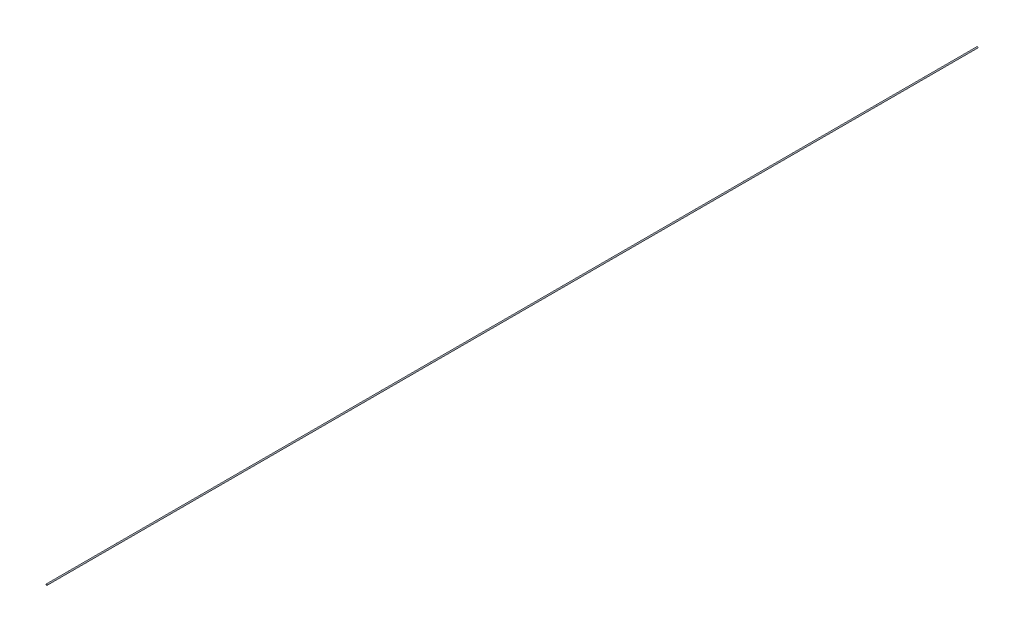
ISO-10303-21;
HEADER;
FILE_DESCRIPTION(('STEP AP214'),'2;1');
FILE_NAME('part.step','',(''),(''),'','','');
FILE_SCHEMA(('AUTOMOTIVE_DESIGN { 1 0 10303 214 1 1 1 1 }'));
ENDSEC;
DATA;
#1=APPLICATION_CONTEXT('core data for automotive mechanical design processes');
#2=APPLICATION_PROTOCOL_DEFINITION('international standard','automotive_design',2000,#1);
#3=PRODUCT_CONTEXT('',#1,'mechanical');
#4=PRODUCT('Part','Part','',(#3));
#5=PRODUCT_RELATED_PRODUCT_CATEGORY('part','',(#4));
#6=PRODUCT_DEFINITION_FORMATION('','',#4);
#7=PRODUCT_DEFINITION_CONTEXT('part definition',#1,'design');
#8=PRODUCT_DEFINITION('design','',#6,#7);
#9=PRODUCT_DEFINITION_SHAPE('','',#8);
#10=(LENGTH_UNIT() NAMED_UNIT(*) SI_UNIT(.MILLI.,.METRE.));
#11=(NAMED_UNIT(*) PLANE_ANGLE_UNIT() SI_UNIT($,.RADIAN.));
#12=(NAMED_UNIT(*) SI_UNIT($,.STERADIAN.) SOLID_ANGLE_UNIT());
#13=UNCERTAINTY_MEASURE_WITH_UNIT(LENGTH_MEASURE(1.E-05),#10,'distance_accuracy_value','');
#14=(GEOMETRIC_REPRESENTATION_CONTEXT(3) GLOBAL_UNCERTAINTY_ASSIGNED_CONTEXT((#13)) GLOBAL_UNIT_ASSIGNED_CONTEXT((#10,
#11,#12)) REPRESENTATION_CONTEXT('',''));
#15=CARTESIAN_POINT('',(0.,0.,0.));
#16=DIRECTION('',(0.,0.,1.));
#17=DIRECTION('',(1.,0.,0.));
#18=AXIS2_PLACEMENT_3D('',#15,#16,#17);
#19=CARTESIAN_POINT('',(0.,0.,100.));
#20=DIRECTION('',(0.,0.,-1.));
#21=DIRECTION('',(-1.,0.,0.));
#22=AXIS2_PLACEMENT_3D('',#19,#20,#21);
#23=CYLINDRICAL_SURFACE('',#22,0.0625);
#24=CARTESIAN_POINT('',(0.,0.,100.));
#25=DIRECTION('',(0.,0.,1.));
#26=DIRECTION('',(1.,0.,0.));
#27=AXIS2_PLACEMENT_3D('',#24,#25,#26);
#28=CIRCLE('',#27,0.0625);
#29=CARTESIAN_POINT('',(0.0625,0.,100.));
#30=VERTEX_POINT('',#29);
#31=EDGE_CURVE('E10',#30,#30,#28,.T.);
#32=ORIENTED_EDGE('',*,*,#31,.F.);
#33=EDGE_LOOP('',(#32));
#34=FACE_BOUND('',#33,.T.);
#35=CARTESIAN_POINT('',(0.,0.,0.));
#36=DIRECTION('',(0.,0.,1.));
#37=DIRECTION('',(1.,0.,0.));
#38=AXIS2_PLACEMENT_3D('',#35,#36,#37);
#39=CIRCLE('',#38,0.0625);
#40=CARTESIAN_POINT('',(0.0625,0.,0.));
#41=VERTEX_POINT('',#40);
#42=EDGE_CURVE('E34',#41,#41,#39,.T.);
#43=ORIENTED_EDGE('',*,*,#42,.T.);
#44=EDGE_LOOP('',(#43));
#45=FACE_BOUND('',#44,.T.);
#46=ADVANCED_FACE('F31',(#34,#45),#23,.T.);
#47=CARTESIAN_POINT('',(0.,0.,100.));
#48=DIRECTION('',(0.,0.,1.));
#49=DIRECTION('',(1.,0.,0.));
#50=AXIS2_PLACEMENT_3D('',#47,#48,#49);
#51=PLANE('',#50);
#52=ORIENTED_EDGE('',*,*,#31,.T.);
#53=EDGE_LOOP('',(#52));
#54=FACE_BOUND('',#53,.T.);
#55=ADVANCED_FACE('F46',(#54),#51,.T.);
#56=CARTESIAN_POINT('',(0.,0.,0.));
#57=DIRECTION('',(0.,0.,1.));
#58=DIRECTION('',(1.,0.,0.));
#59=AXIS2_PLACEMENT_3D('',#56,#57,#58);
#60=PLANE('',#59);
#61=ORIENTED_EDGE('',*,*,#42,.F.);
#62=EDGE_LOOP('',(#61));
#63=FACE_BOUND('',#62,.T.);
#64=ADVANCED_FACE('F44',(#63),#60,.F.);
#65=CLOSED_SHELL('',(#46,#55,#64));
#66=MANIFOLD_SOLID_BREP('B2',#65);
#67=ADVANCED_BREP_SHAPE_REPRESENTATION('',(#18,#66),#14);
#68=SHAPE_DEFINITION_REPRESENTATION(#9,#67);
ENDSEC;
END-ISO-10303-21;
